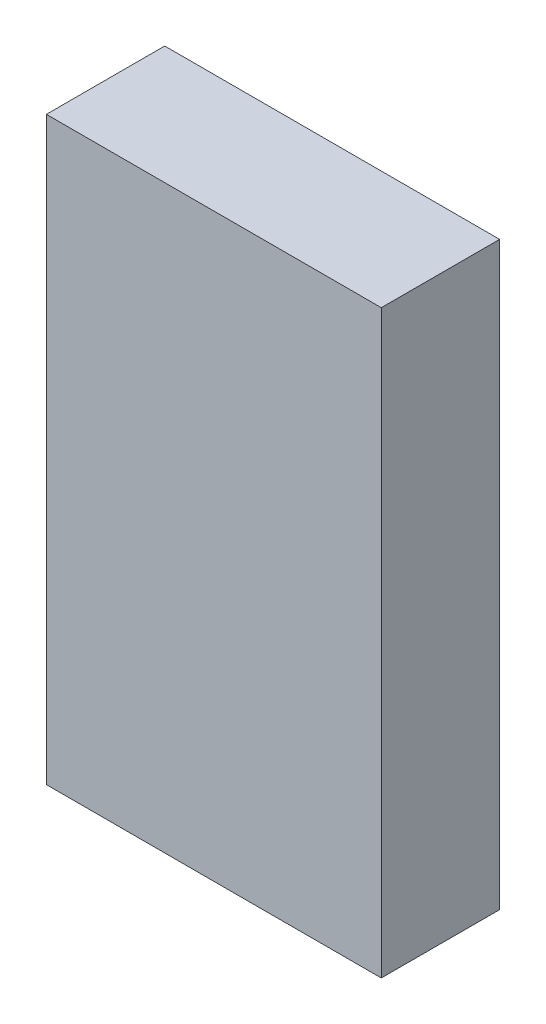
ISO-10303-21;
HEADER;
FILE_DESCRIPTION(('STEP AP214'),'2;1');
FILE_NAME('part.step','',(''),(''),'','','');
FILE_SCHEMA(('AUTOMOTIVE_DESIGN { 1 0 10303 214 1 1 1 1 }'));
ENDSEC;
DATA;
#1=APPLICATION_CONTEXT('core data for automotive mechanical design processes');
#2=APPLICATION_PROTOCOL_DEFINITION('international standard','automotive_design',2000,#1);
#3=PRODUCT_CONTEXT('',#1,'mechanical');
#4=PRODUCT('Part','Part','',(#3));
#5=PRODUCT_RELATED_PRODUCT_CATEGORY('part','',(#4));
#6=PRODUCT_DEFINITION_FORMATION('','',#4);
#7=PRODUCT_DEFINITION_CONTEXT('part definition',#1,'design');
#8=PRODUCT_DEFINITION('design','',#6,#7);
#9=PRODUCT_DEFINITION_SHAPE('','',#8);
#10=(LENGTH_UNIT() NAMED_UNIT(*) SI_UNIT(.MILLI.,.METRE.));
#11=(NAMED_UNIT(*) PLANE_ANGLE_UNIT() SI_UNIT($,.RADIAN.));
#12=(NAMED_UNIT(*) SI_UNIT($,.STERADIAN.) SOLID_ANGLE_UNIT());
#13=UNCERTAINTY_MEASURE_WITH_UNIT(LENGTH_MEASURE(1.E-05),#10,'distance_accuracy_value','');
#14=(GEOMETRIC_REPRESENTATION_CONTEXT(3) GLOBAL_UNCERTAINTY_ASSIGNED_CONTEXT((#13)) GLOBAL_UNIT_ASSIGNED_CONTEXT((#10,
#11,#12)) REPRESENTATION_CONTEXT('',''));
#15=CARTESIAN_POINT('',(0.,0.,0.));
#16=DIRECTION('',(0.,0.,1.));
#17=DIRECTION('',(1.,0.,0.));
#18=AXIS2_PLACEMENT_3D('',#15,#16,#17);
#19=CARTESIAN_POINT('',(-3.75000012,-6.4999997,2.65));
#20=DIRECTION('',(0.,0.,-1.));
#21=DIRECTION('',(-1.,0.,0.));
#22=AXIS2_PLACEMENT_3D('',#19,#20,#21);
#23=PLANE('',#22);
#24=DIRECTION('',(0.,1.,0.));
#25=VECTOR('',#24,1.);
#26=CARTESIAN_POINT('',(3.75000012,-6.4999997,2.65));
#27=LINE('',#26,#25);
#28=CARTESIAN_POINT('',(3.75000012,-6.4999997,2.65));
#29=VERTEX_POINT('',#28);
#30=CARTESIAN_POINT('',(3.75000012,6.4999997,2.65));
#31=VERTEX_POINT('',#30);
#32=EDGE_CURVE('E55',#29,#31,#27,.T.);
#33=ORIENTED_EDGE('',*,*,#32,.T.);
#34=DIRECTION('',(1.,0.,0.));
#35=VECTOR('',#34,1.);
#36=CARTESIAN_POINT('',(3.75000012,6.4999997,2.65));
#37=LINE('',#36,#35);
#38=CARTESIAN_POINT('',(-3.75000012,6.4999997,2.65));
#39=VERTEX_POINT('',#38);
#40=EDGE_CURVE('E57',#31,#39,#37,.F.);
#41=ORIENTED_EDGE('',*,*,#40,.T.);
#42=DIRECTION('',(0.,1.,0.));
#43=VECTOR('',#42,1.);
#44=CARTESIAN_POINT('',(-3.75000012,6.4999997,2.65));
#45=LINE('',#44,#43);
#46=CARTESIAN_POINT('',(-3.75000012,-6.4999997,2.65));
#47=VERTEX_POINT('',#46);
#48=EDGE_CURVE('E20',#39,#47,#45,.F.);
#49=ORIENTED_EDGE('',*,*,#48,.T.);
#50=DIRECTION('',(1.,0.,0.));
#51=VECTOR('',#50,1.);
#52=CARTESIAN_POINT('',(-3.75000012,-6.4999997,2.65));
#53=LINE('',#52,#51);
#54=EDGE_CURVE('E80',#47,#29,#53,.T.);
#55=ORIENTED_EDGE('',*,*,#54,.T.);
#56=EDGE_LOOP('',(#33,#41,#49,#55));
#57=FACE_BOUND('',#56,.T.);
#58=ADVANCED_FACE('F17',(#57),#23,.F.);
#59=CARTESIAN_POINT('',(-3.75000012,6.4999997,0.));
#60=DIRECTION('',(1.,0.,0.));
#61=DIRECTION('',(0.,0.,-1.));
#62=AXIS2_PLACEMENT_3D('',#59,#60,#61);
#63=PLANE('',#62);
#64=DIRECTION('',(0.,0.,1.));
#65=VECTOR('',#64,1.);
#66=CARTESIAN_POINT('',(-3.75000012,-6.4999997,0.));
#67=LINE('',#66,#65);
#68=CARTESIAN_POINT('',(-3.75000012,-6.4999997,0.));
#69=VERTEX_POINT('',#68);
#70=EDGE_CURVE('E68',#69,#47,#67,.T.);
#71=ORIENTED_EDGE('',*,*,#70,.T.);
#72=ORIENTED_EDGE('',*,*,#48,.F.);
#73=DIRECTION('',(0.,0.,-1.));
#74=VECTOR('',#73,1.);
#75=CARTESIAN_POINT('',(-3.75000012,6.4999997,0.));
#76=LINE('',#75,#74);
#77=CARTESIAN_POINT('',(-3.75000012,6.4999997,0.));
#78=VERTEX_POINT('',#77);
#79=EDGE_CURVE('E63',#39,#78,#76,.T.);
#80=ORIENTED_EDGE('',*,*,#79,.T.);
#81=DIRECTION('',(0.,1.,0.));
#82=VECTOR('',#81,1.);
#83=CARTESIAN_POINT('',(-3.75000012,-6.4999997,0.));
#84=LINE('',#83,#82);
#85=EDGE_CURVE('E83',#69,#78,#84,.T.);
#86=ORIENTED_EDGE('',*,*,#85,.F.);
#87=EDGE_LOOP('',(#71,#72,#80,#86));
#88=FACE_BOUND('',#87,.T.);
#89=ADVANCED_FACE('F65',(#88),#63,.F.);
#90=CARTESIAN_POINT('',(3.75000012,6.4999997,0.));
#91=DIRECTION('',(0.,-1.,0.));
#92=DIRECTION('',(0.,0.,-1.));
#93=AXIS2_PLACEMENT_3D('',#90,#91,#92);
#94=PLANE('',#93);
#95=ORIENTED_EDGE('',*,*,#79,.F.);
#96=ORIENTED_EDGE('',*,*,#40,.F.);
#97=DIRECTION('',(0.,0.,1.));
#98=VECTOR('',#97,1.);
#99=CARTESIAN_POINT('',(3.75000012,6.4999997,0.));
#100=LINE('',#99,#98);
#101=CARTESIAN_POINT('',(3.75000012,6.4999997,0.));
#102=VERTEX_POINT('',#101);
#103=EDGE_CURVE('E75',#31,#102,#100,.F.);
#104=ORIENTED_EDGE('',*,*,#103,.T.);
#105=DIRECTION('',(-1.,0.,0.));
#106=VECTOR('',#105,1.);
#107=CARTESIAN_POINT('',(-3.75000012,6.4999997,0.));
#108=LINE('',#107,#106);
#109=EDGE_CURVE('E72',#78,#102,#108,.F.);
#110=ORIENTED_EDGE('',*,*,#109,.F.);
#111=EDGE_LOOP('',(#95,#96,#104,#110));
#112=FACE_BOUND('',#111,.T.);
#113=ADVANCED_FACE('F70',(#112),#94,.F.);
#114=CARTESIAN_POINT('',(3.75000012,-6.4999997,0.));
#115=DIRECTION('',(-1.,0.,0.));
#116=DIRECTION('',(0.,0.,1.));
#117=AXIS2_PLACEMENT_3D('',#114,#115,#116);
#118=PLANE('',#117);
#119=ORIENTED_EDGE('',*,*,#103,.F.);
#120=ORIENTED_EDGE('',*,*,#32,.F.);
#121=DIRECTION('',(0.,0.,1.));
#122=VECTOR('',#121,1.);
#123=CARTESIAN_POINT('',(3.75000012,-6.4999997,0.));
#124=LINE('',#123,#122);
#125=CARTESIAN_POINT('',(3.75000012,-6.4999997,0.));
#126=VERTEX_POINT('',#125);
#127=EDGE_CURVE('E35',#29,#126,#124,.F.);
#128=ORIENTED_EDGE('',*,*,#127,.T.);
#129=DIRECTION('',(0.,1.,0.));
#130=VECTOR('',#129,1.);
#131=CARTESIAN_POINT('',(3.75000012,-6.4999997,0.));
#132=LINE('',#131,#130);
#133=EDGE_CURVE('E26',#102,#126,#132,.F.);
#134=ORIENTED_EDGE('',*,*,#133,.F.);
#135=EDGE_LOOP('',(#119,#120,#128,#134));
#136=FACE_BOUND('',#135,.T.);
#137=ADVANCED_FACE('F89',(#136),#118,.F.);
#138=CARTESIAN_POINT('',(-3.75000012,-6.4999997,0.));
#139=DIRECTION('',(0.,1.,0.));
#140=DIRECTION('',(0.,0.,1.));
#141=AXIS2_PLACEMENT_3D('',#138,#139,#140);
#142=PLANE('',#141);
#143=ORIENTED_EDGE('',*,*,#127,.F.);
#144=ORIENTED_EDGE('',*,*,#54,.F.);
#145=ORIENTED_EDGE('',*,*,#70,.F.);
#146=DIRECTION('',(-1.,0.,0.));
#147=VECTOR('',#146,1.);
#148=CARTESIAN_POINT('',(-3.75000012,-6.4999997,0.));
#149=LINE('',#148,#147);
#150=EDGE_CURVE('E11',#126,#69,#149,.T.);
#151=ORIENTED_EDGE('',*,*,#150,.F.);
#152=EDGE_LOOP('',(#143,#144,#145,#151));
#153=FACE_BOUND('',#152,.T.);
#154=ADVANCED_FACE('F91',(#153),#142,.F.);
#155=CARTESIAN_POINT('',(-3.75000012,-6.4999997,0.));
#156=DIRECTION('',(0.,0.,-1.));
#157=DIRECTION('',(-1.,0.,0.));
#158=AXIS2_PLACEMENT_3D('',#155,#156,#157);
#159=PLANE('',#158);
#160=ORIENTED_EDGE('',*,*,#133,.T.);
#161=ORIENTED_EDGE('',*,*,#150,.T.);
#162=ORIENTED_EDGE('',*,*,#85,.T.);
#163=ORIENTED_EDGE('',*,*,#109,.T.);
#164=EDGE_LOOP('',(#160,#161,#162,#163));
#165=FACE_BOUND('',#164,.T.);
#166=ADVANCED_FACE('F88',(#165),#159,.T.);
#167=CLOSED_SHELL('',(#58,#89,#113,#137,#154,#166));
#168=MANIFOLD_SOLID_BREP('B1',#167);
#169=ADVANCED_BREP_SHAPE_REPRESENTATION('',(#18,#168),#14);
#170=SHAPE_DEFINITION_REPRESENTATION(#9,#169);
ENDSEC;
END-ISO-10303-21;
